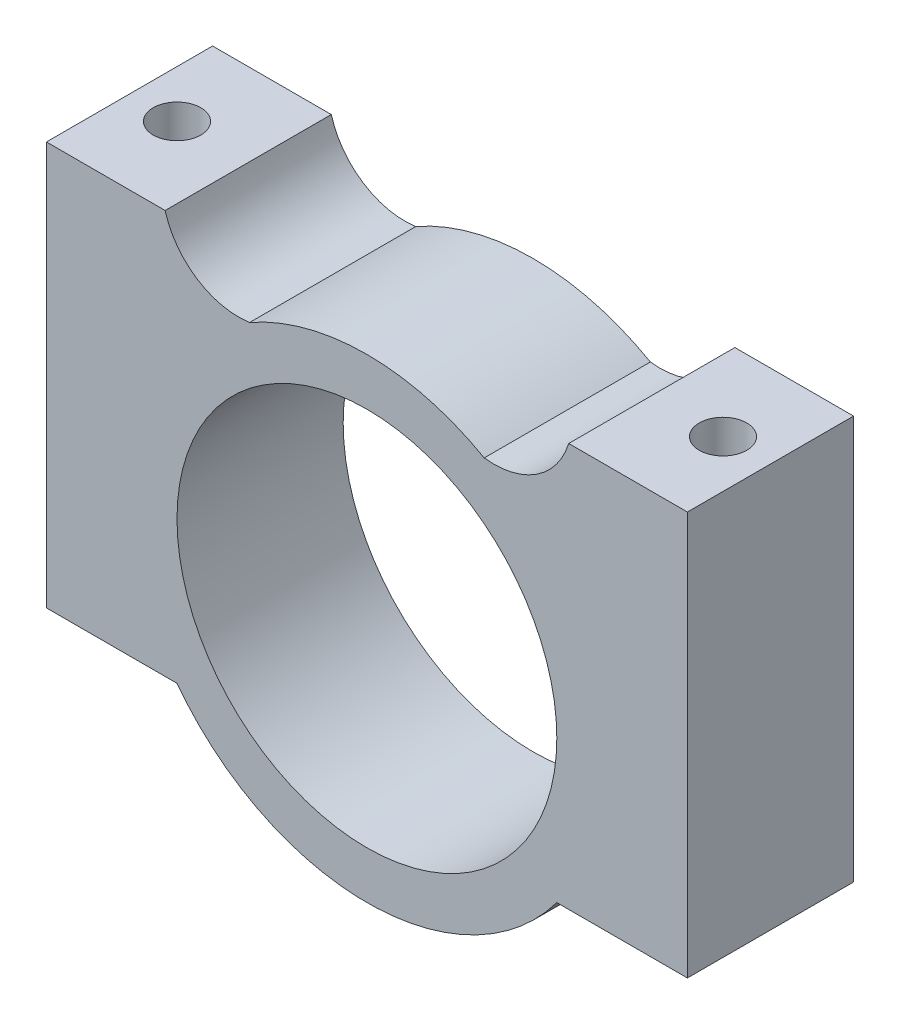
ISO-10303-21;
HEADER;
FILE_DESCRIPTION(('STEP AP214'),'2;1');
FILE_NAME('part.step','',(''),(''),'','','');
FILE_SCHEMA(('AUTOMOTIVE_DESIGN { 1 0 10303 214 1 1 1 1 }'));
ENDSEC;
DATA;
#1=APPLICATION_CONTEXT('core data for automotive mechanical design processes');
#2=APPLICATION_PROTOCOL_DEFINITION('international standard','automotive_design',2000,#1);
#3=PRODUCT_CONTEXT('',#1,'mechanical');
#4=PRODUCT('Part','Part','',(#3));
#5=PRODUCT_RELATED_PRODUCT_CATEGORY('part','',(#4));
#6=PRODUCT_DEFINITION_FORMATION('','',#4);
#7=PRODUCT_DEFINITION_CONTEXT('part definition',#1,'design');
#8=PRODUCT_DEFINITION('design','',#6,#7);
#9=PRODUCT_DEFINITION_SHAPE('','',#8);
#10=(LENGTH_UNIT() NAMED_UNIT(*) SI_UNIT(.MILLI.,.METRE.));
#11=(NAMED_UNIT(*) PLANE_ANGLE_UNIT() SI_UNIT($,.RADIAN.));
#12=(NAMED_UNIT(*) SI_UNIT($,.STERADIAN.) SOLID_ANGLE_UNIT());
#13=UNCERTAINTY_MEASURE_WITH_UNIT(LENGTH_MEASURE(1.E-05),#10,'distance_accuracy_value','');
#14=(GEOMETRIC_REPRESENTATION_CONTEXT(3) GLOBAL_UNCERTAINTY_ASSIGNED_CONTEXT((#13)) GLOBAL_UNIT_ASSIGNED_CONTEXT((#10,
#11,#12)) REPRESENTATION_CONTEXT('',''));
#15=CARTESIAN_POINT('',(0.,0.,0.));
#16=DIRECTION('',(0.,0.,1.));
#17=DIRECTION('',(1.,0.,0.));
#18=AXIS2_PLACEMENT_3D('',#15,#16,#17);
#19=CARTESIAN_POINT('',(5.35227036600319,9.45869811016463,7.));
#20=DIRECTION('',(0.,0.,-1.));
#21=DIRECTION('',(-1.,0.,0.));
#22=AXIS2_PLACEMENT_3D('',#19,#20,#21);
#23=PLANE('',#22);
#24=DIRECTION('',(1.,0.,0.));
#25=VECTOR('',#24,1.);
#26=CARTESIAN_POINT('',(8.,-8.5,7.));
#27=LINE('',#26,#25);
#28=CARTESIAN_POINT('',(8.,-8.5,7.));
#29=VERTEX_POINT('',#28);
#30=CARTESIAN_POINT('',(13.5,-8.5,7.));
#31=VERTEX_POINT('',#30);
#32=EDGE_CURVE('E186',#29,#31,#27,.T.);
#33=ORIENTED_EDGE('',*,*,#32,.T.);
#34=DIRECTION('',(0.,1.,0.));
#35=VECTOR('',#34,1.);
#36=CARTESIAN_POINT('',(13.5,8.5,7.));
#37=LINE('',#36,#35);
#38=CARTESIAN_POINT('',(13.5,8.5,7.));
#39=VERTEX_POINT('',#38);
#40=EDGE_CURVE('E110',#31,#39,#37,.T.);
#41=ORIENTED_EDGE('',*,*,#40,.T.);
#42=DIRECTION('',(-1.,0.,0.));
#43=VECTOR('',#42,1.);
#44=CARTESIAN_POINT('',(8.5,8.5,7.));
#45=LINE('',#44,#43);
#46=CARTESIAN_POINT('',(8.5,8.5,7.));
#47=VERTEX_POINT('',#46);
#48=EDGE_CURVE('E216',#39,#47,#45,.T.);
#49=ORIENTED_EDGE('',*,*,#48,.T.);
#50=CARTESIAN_POINT('',(5.35227036600319,9.45869811016463,7.));
#51=DIRECTION('',(0.,0.,-1.));
#52=DIRECTION('',(-1.,0.,0.));
#53=AXIS2_PLACEMENT_3D('',#50,#51,#52);
#54=CIRCLE('',#53,3.2904868811735);
#55=CARTESIAN_POINT('',(4.94108254715886,6.19400386830844,7.));
#56=VERTEX_POINT('',#55);
#57=EDGE_CURVE('E236',#47,#56,#54,.T.);
#58=ORIENTED_EDGE('',*,*,#57,.T.);
#59=CARTESIAN_POINT('',(0.,-2.5,7.));
#60=DIRECTION('',(0.,0.,1.));
#61=DIRECTION('',(1.,0.,0.));
#62=AXIS2_PLACEMENT_3D('',#59,#60,#61);
#63=CIRCLE('',#62,10.);
#64=CARTESIAN_POINT('',(-4.94108254715886,6.19400386830844,7.));
#65=VERTEX_POINT('',#64);
#66=EDGE_CURVE('E232',#56,#65,#63,.T.);
#67=ORIENTED_EDGE('',*,*,#66,.T.);
#68=CARTESIAN_POINT('',(-5.40975809367256,9.36997546466018,7.));
#69=DIRECTION('',(0.,0.,-1.));
#70=DIRECTION('',(1.,0.,0.));
#71=AXIS2_PLACEMENT_3D('',#68,#69,#70);
#72=CIRCLE('',#71,3.21036638855022);
#73=CARTESIAN_POINT('',(-8.5,8.5,7.));
#74=VERTEX_POINT('',#73);
#75=EDGE_CURVE('E235',#65,#74,#72,.T.);
#76=ORIENTED_EDGE('',*,*,#75,.T.);
#77=DIRECTION('',(-1.,0.,0.));
#78=VECTOR('',#77,1.);
#79=CARTESIAN_POINT('',(-13.5,8.5,7.));
#80=LINE('',#79,#78);
#81=CARTESIAN_POINT('',(-13.5,8.5,7.));
#82=VERTEX_POINT('',#81);
#83=EDGE_CURVE('E135',#74,#82,#80,.T.);
#84=ORIENTED_EDGE('',*,*,#83,.T.);
#85=DIRECTION('',(0.,-1.,0.));
#86=VECTOR('',#85,1.);
#87=CARTESIAN_POINT('',(-13.5,8.5,7.));
#88=LINE('',#87,#86);
#89=CARTESIAN_POINT('',(-13.5,-8.5,7.));
#90=VERTEX_POINT('',#89);
#91=EDGE_CURVE('E129',#82,#90,#88,.T.);
#92=ORIENTED_EDGE('',*,*,#91,.T.);
#93=DIRECTION('',(1.,0.,0.));
#94=VECTOR('',#93,1.);
#95=CARTESIAN_POINT('',(-13.5,-8.5,7.));
#96=LINE('',#95,#94);
#97=CARTESIAN_POINT('',(-8.,-8.5,7.));
#98=VERTEX_POINT('',#97);
#99=EDGE_CURVE('E133',#90,#98,#96,.T.);
#100=ORIENTED_EDGE('',*,*,#99,.T.);
#101=CARTESIAN_POINT('',(0.,-2.5,7.));
#102=DIRECTION('',(0.,0.,1.));
#103=DIRECTION('',(1.,0.,0.));
#104=AXIS2_PLACEMENT_3D('',#101,#102,#103);
#105=CIRCLE('',#104,10.);
#106=EDGE_CURVE('E61',#98,#29,#105,.T.);
#107=ORIENTED_EDGE('',*,*,#106,.T.);
#108=EDGE_LOOP('',(#33,#41,#49,#58,#67,#76,#84,#92,#100,#107));
#109=FACE_BOUND('',#108,.T.);
#110=CARTESIAN_POINT('',(0.,-2.5,7.));
#111=DIRECTION('',(0.,0.,1.));
#112=DIRECTION('',(1.,0.,0.));
#113=AXIS2_PLACEMENT_3D('',#110,#111,#112);
#114=CIRCLE('',#113,8.);
#115=CARTESIAN_POINT('',(8.,-2.5,7.));
#116=VERTEX_POINT('',#115);
#117=EDGE_CURVE('E162',#116,#116,#114,.T.);
#118=ORIENTED_EDGE('',*,*,#117,.F.);
#119=EDGE_LOOP('',(#118));
#120=FACE_BOUND('',#119,.T.);
#121=ADVANCED_FACE('F42',(#109,#120),#23,.F.);
#122=CARTESIAN_POINT('',(5.35227036600319,9.45869811016463,0.));
#123=DIRECTION('',(0.,0.,-1.));
#124=DIRECTION('',(-1.,0.,0.));
#125=AXIS2_PLACEMENT_3D('',#122,#123,#124);
#126=PLANE('',#125);
#127=DIRECTION('',(1.,0.,0.));
#128=VECTOR('',#127,1.);
#129=CARTESIAN_POINT('',(8.,-8.5,0.));
#130=LINE('',#129,#128);
#131=CARTESIAN_POINT('',(8.,-8.5,0.));
#132=VERTEX_POINT('',#131);
#133=CARTESIAN_POINT('',(13.5,-8.5,0.));
#134=VERTEX_POINT('',#133);
#135=EDGE_CURVE('E157',#132,#134,#130,.T.);
#136=ORIENTED_EDGE('',*,*,#135,.F.);
#137=CARTESIAN_POINT('',(0.,-2.5,0.));
#138=DIRECTION('',(0.,0.,1.));
#139=DIRECTION('',(1.,0.,0.));
#140=AXIS2_PLACEMENT_3D('',#137,#138,#139);
#141=CIRCLE('',#140,10.);
#142=CARTESIAN_POINT('',(-8.,-8.5,0.));
#143=VERTEX_POINT('',#142);
#144=EDGE_CURVE('E102',#143,#132,#141,.T.);
#145=ORIENTED_EDGE('',*,*,#144,.F.);
#146=DIRECTION('',(1.,0.,0.));
#147=VECTOR('',#146,1.);
#148=CARTESIAN_POINT('',(-13.5,-8.5,0.));
#149=LINE('',#148,#147);
#150=CARTESIAN_POINT('',(-13.5,-8.5,0.));
#151=VERTEX_POINT('',#150);
#152=EDGE_CURVE('E96',#151,#143,#149,.T.);
#153=ORIENTED_EDGE('',*,*,#152,.F.);
#154=DIRECTION('',(0.,-1.,0.));
#155=VECTOR('',#154,1.);
#156=CARTESIAN_POINT('',(-13.5,8.5,0.));
#157=LINE('',#156,#155);
#158=CARTESIAN_POINT('',(-13.5,8.5,0.));
#159=VERTEX_POINT('',#158);
#160=EDGE_CURVE('E144',#159,#151,#157,.T.);
#161=ORIENTED_EDGE('',*,*,#160,.F.);
#162=DIRECTION('',(-1.,0.,0.));
#163=VECTOR('',#162,1.);
#164=CARTESIAN_POINT('',(-13.5,8.5,0.));
#165=LINE('',#164,#163);
#166=CARTESIAN_POINT('',(-8.5,8.5,0.));
#167=VERTEX_POINT('',#166);
#168=EDGE_CURVE('E177',#167,#159,#165,.T.);
#169=ORIENTED_EDGE('',*,*,#168,.F.);
#170=CARTESIAN_POINT('',(-5.40975809367256,9.36997546466018,0.));
#171=DIRECTION('',(0.,0.,-1.));
#172=DIRECTION('',(1.,0.,0.));
#173=AXIS2_PLACEMENT_3D('',#170,#171,#172);
#174=CIRCLE('',#173,3.21036638855022);
#175=CARTESIAN_POINT('',(-4.94108254715886,6.19400386830844,0.));
#176=VERTEX_POINT('',#175);
#177=EDGE_CURVE('E174',#176,#167,#174,.T.);
#178=ORIENTED_EDGE('',*,*,#177,.F.);
#179=CARTESIAN_POINT('',(0.,-2.5,0.));
#180=DIRECTION('',(0.,0.,1.));
#181=DIRECTION('',(1.,0.,0.));
#182=AXIS2_PLACEMENT_3D('',#179,#180,#181);
#183=CIRCLE('',#182,10.);
#184=CARTESIAN_POINT('',(4.94108254715886,6.19400386830844,0.));
#185=VERTEX_POINT('',#184);
#186=EDGE_CURVE('E171',#185,#176,#183,.T.);
#187=ORIENTED_EDGE('',*,*,#186,.F.);
#188=CARTESIAN_POINT('',(5.35227036600319,9.45869811016463,0.));
#189=DIRECTION('',(0.,0.,-1.));
#190=DIRECTION('',(-1.,0.,0.));
#191=AXIS2_PLACEMENT_3D('',#188,#189,#190);
#192=CIRCLE('',#191,3.2904868811735);
#193=CARTESIAN_POINT('',(8.5,8.5,0.));
#194=VERTEX_POINT('',#193);
#195=EDGE_CURVE('E168',#194,#185,#192,.T.);
#196=ORIENTED_EDGE('',*,*,#195,.F.);
#197=DIRECTION('',(-1.,0.,0.));
#198=VECTOR('',#197,1.);
#199=CARTESIAN_POINT('',(8.5,8.5,0.));
#200=LINE('',#199,#198);
#201=CARTESIAN_POINT('',(13.5,8.5,0.));
#202=VERTEX_POINT('',#201);
#203=EDGE_CURVE('E165',#202,#194,#200,.T.);
#204=ORIENTED_EDGE('',*,*,#203,.F.);
#205=DIRECTION('',(0.,1.,0.));
#206=VECTOR('',#205,1.);
#207=CARTESIAN_POINT('',(13.5,8.5,0.));
#208=LINE('',#207,#206);
#209=EDGE_CURVE('E161',#134,#202,#208,.T.);
#210=ORIENTED_EDGE('',*,*,#209,.F.);
#211=EDGE_LOOP('',(#136,#145,#153,#161,#169,#178,#187,#196,#204,#210));
#212=FACE_BOUND('',#211,.T.);
#213=CARTESIAN_POINT('',(0.,-2.5,0.));
#214=DIRECTION('',(0.,0.,1.));
#215=DIRECTION('',(1.,0.,0.));
#216=AXIS2_PLACEMENT_3D('',#213,#214,#215);
#217=CIRCLE('',#216,8.);
#218=CARTESIAN_POINT('',(8.,-2.5,0.));
#219=VERTEX_POINT('',#218);
#220=EDGE_CURVE('E250',#219,#219,#217,.T.);
#221=ORIENTED_EDGE('',*,*,#220,.T.);
#222=EDGE_LOOP('',(#221));
#223=FACE_BOUND('',#222,.T.);
#224=ADVANCED_FACE('F220',(#212,#223),#126,.T.);
#225=CARTESIAN_POINT('',(8.,-8.5,7.));
#226=DIRECTION('',(0.,1.,0.));
#227=DIRECTION('',(-1.,0.,0.));
#228=AXIS2_PLACEMENT_3D('',#225,#226,#227);
#229=PLANE('',#228);
#230=CARTESIAN_POINT('',(11.5,-8.5,3.5));
#231=DIRECTION('',(0.,1.,0.));
#232=DIRECTION('',(-1.,0.,0.));
#233=AXIS2_PLACEMENT_3D('',#230,#231,#232);
#234=CIRCLE('',#233,1.);
#235=CARTESIAN_POINT('',(10.5,-8.5,3.5));
#236=VERTEX_POINT('',#235);
#237=EDGE_CURVE('E254',#236,#236,#234,.T.);
#238=ORIENTED_EDGE('',*,*,#237,.T.);
#239=EDGE_LOOP('',(#238));
#240=FACE_BOUND('',#239,.T.);
#241=ORIENTED_EDGE('',*,*,#135,.T.);
#242=DIRECTION('',(0.,0.,-1.));
#243=VECTOR('',#242,1.);
#244=CARTESIAN_POINT('',(13.5,-8.5,7.));
#245=LINE('',#244,#243);
#246=EDGE_CURVE('E11',#31,#134,#245,.T.);
#247=ORIENTED_EDGE('',*,*,#246,.F.);
#248=ORIENTED_EDGE('',*,*,#32,.F.);
#249=DIRECTION('',(0.,0.,-1.));
#250=VECTOR('',#249,1.);
#251=CARTESIAN_POINT('',(8.,-8.5,7.));
#252=LINE('',#251,#250);
#253=EDGE_CURVE('E153',#29,#132,#252,.T.);
#254=ORIENTED_EDGE('',*,*,#253,.T.);
#255=EDGE_LOOP('',(#241,#247,#248,#254));
#256=FACE_BOUND('',#255,.T.);
#257=ADVANCED_FACE('F44',(#240,#256),#229,.F.);
#258=CARTESIAN_POINT('',(13.5,8.5,7.));
#259=DIRECTION('',(-1.,0.,0.));
#260=DIRECTION('',(0.,-1.,0.));
#261=AXIS2_PLACEMENT_3D('',#258,#259,#260);
#262=PLANE('',#261);
#263=ORIENTED_EDGE('',*,*,#209,.T.);
#264=DIRECTION('',(0.,0.,-1.));
#265=VECTOR('',#264,1.);
#266=CARTESIAN_POINT('',(13.5,8.5,7.));
#267=LINE('',#266,#265);
#268=EDGE_CURVE('E53',#39,#202,#267,.T.);
#269=ORIENTED_EDGE('',*,*,#268,.F.);
#270=ORIENTED_EDGE('',*,*,#40,.F.);
#271=ORIENTED_EDGE('',*,*,#246,.T.);
#272=EDGE_LOOP('',(#263,#269,#270,#271));
#273=FACE_BOUND('',#272,.T.);
#274=ADVANCED_FACE('F315',(#273),#262,.F.);
#275=CARTESIAN_POINT('',(8.5,8.5,7.));
#276=DIRECTION('',(0.,-1.,0.));
#277=DIRECTION('',(0.,0.,-1.));
#278=AXIS2_PLACEMENT_3D('',#275,#276,#277);
#279=PLANE('',#278);
#280=CARTESIAN_POINT('',(11.5,8.5,3.5));
#281=DIRECTION('',(0.,1.,0.));
#282=DIRECTION('',(0.,0.,1.));
#283=AXIS2_PLACEMENT_3D('',#280,#281,#282);
#284=CIRCLE('',#283,1.);
#285=CARTESIAN_POINT('',(11.5,8.5,4.5));
#286=VERTEX_POINT('',#285);
#287=EDGE_CURVE('E261',#286,#286,#284,.T.);
#288=ORIENTED_EDGE('',*,*,#287,.F.);
#289=EDGE_LOOP('',(#288));
#290=FACE_BOUND('',#289,.T.);
#291=ORIENTED_EDGE('',*,*,#203,.T.);
#292=DIRECTION('',(0.,0.,-1.));
#293=VECTOR('',#292,1.);
#294=CARTESIAN_POINT('',(8.5,8.5,7.));
#295=LINE('',#294,#293);
#296=EDGE_CURVE('E205',#47,#194,#295,.T.);
#297=ORIENTED_EDGE('',*,*,#296,.F.);
#298=ORIENTED_EDGE('',*,*,#48,.F.);
#299=ORIENTED_EDGE('',*,*,#268,.T.);
#300=EDGE_LOOP('',(#291,#297,#298,#299));
#301=FACE_BOUND('',#300,.T.);
#302=ADVANCED_FACE('F214',(#290,#301),#279,.F.);
#303=CARTESIAN_POINT('',(5.35227036600319,9.45869811016463,7.));
#304=DIRECTION('',(0.,0.,-1.));
#305=DIRECTION('',(-1.,0.,0.));
#306=AXIS2_PLACEMENT_3D('',#303,#304,#305);
#307=CYLINDRICAL_SURFACE('',#306,3.2904868811735);
#308=ORIENTED_EDGE('',*,*,#195,.T.);
#309=DIRECTION('',(0.,0.,-1.));
#310=VECTOR('',#309,1.);
#311=CARTESIAN_POINT('',(4.94108254715886,6.19400386830844,7.));
#312=LINE('',#311,#310);
#313=EDGE_CURVE('E201',#56,#185,#312,.T.);
#314=ORIENTED_EDGE('',*,*,#313,.F.);
#315=ORIENTED_EDGE('',*,*,#57,.F.);
#316=ORIENTED_EDGE('',*,*,#296,.T.);
#317=EDGE_LOOP('',(#308,#314,#315,#316));
#318=FACE_BOUND('',#317,.T.);
#319=ADVANCED_FACE('F226',(#318),#307,.F.);
#320=CARTESIAN_POINT('',(0.,-2.5,7.));
#321=DIRECTION('',(0.,0.,-1.));
#322=DIRECTION('',(-1.,0.,0.));
#323=AXIS2_PLACEMENT_3D('',#320,#321,#322);
#324=CYLINDRICAL_SURFACE('',#323,10.);
#325=ORIENTED_EDGE('',*,*,#186,.T.);
#326=DIRECTION('',(0.,0.,-1.));
#327=VECTOR('',#326,1.);
#328=CARTESIAN_POINT('',(-4.94108254715886,6.19400386830844,7.));
#329=LINE('',#328,#327);
#330=EDGE_CURVE('E197',#65,#176,#329,.T.);
#331=ORIENTED_EDGE('',*,*,#330,.F.);
#332=ORIENTED_EDGE('',*,*,#66,.F.);
#333=ORIENTED_EDGE('',*,*,#313,.T.);
#334=EDGE_LOOP('',(#325,#331,#332,#333));
#335=FACE_BOUND('',#334,.T.);
#336=ADVANCED_FACE('F230',(#335),#324,.T.);
#337=CARTESIAN_POINT('',(-5.40975809367256,9.36997546466018,7.));
#338=DIRECTION('',(0.,0.,-1.));
#339=DIRECTION('',(-1.,0.,0.));
#340=AXIS2_PLACEMENT_3D('',#337,#338,#339);
#341=CYLINDRICAL_SURFACE('',#340,3.21036638855022);
#342=ORIENTED_EDGE('',*,*,#177,.T.);
#343=DIRECTION('',(0.,0.,-1.));
#344=VECTOR('',#343,1.);
#345=CARTESIAN_POINT('',(-8.5,8.5,7.));
#346=LINE('',#345,#344);
#347=EDGE_CURVE('E193',#74,#167,#346,.T.);
#348=ORIENTED_EDGE('',*,*,#347,.F.);
#349=ORIENTED_EDGE('',*,*,#75,.F.);
#350=ORIENTED_EDGE('',*,*,#330,.T.);
#351=EDGE_LOOP('',(#342,#348,#349,#350));
#352=FACE_BOUND('',#351,.T.);
#353=ADVANCED_FACE('F305',(#352),#341,.F.);
#354=CARTESIAN_POINT('',(-13.5,8.5,7.));
#355=DIRECTION('',(0.,-1.,0.));
#356=DIRECTION('',(0.,0.,-1.));
#357=AXIS2_PLACEMENT_3D('',#354,#355,#356);
#358=PLANE('',#357);
#359=CARTESIAN_POINT('',(-11.5,8.5,3.5));
#360=DIRECTION('',(0.,1.,0.));
#361=DIRECTION('',(0.,0.,1.));
#362=AXIS2_PLACEMENT_3D('',#359,#360,#361);
#363=CIRCLE('',#362,1.);
#364=CARTESIAN_POINT('',(-11.5,8.5,4.5));
#365=VERTEX_POINT('',#364);
#366=EDGE_CURVE('E265',#365,#365,#363,.T.);
#367=ORIENTED_EDGE('',*,*,#366,.F.);
#368=EDGE_LOOP('',(#367));
#369=FACE_BOUND('',#368,.T.);
#370=ORIENTED_EDGE('',*,*,#168,.T.);
#371=DIRECTION('',(0.,0.,-1.));
#372=VECTOR('',#371,1.);
#373=CARTESIAN_POINT('',(-13.5,8.5,7.));
#374=LINE('',#373,#372);
#375=EDGE_CURVE('E146',#82,#159,#374,.T.);
#376=ORIENTED_EDGE('',*,*,#375,.F.);
#377=ORIENTED_EDGE('',*,*,#83,.F.);
#378=ORIENTED_EDGE('',*,*,#347,.T.);
#379=EDGE_LOOP('',(#370,#376,#377,#378));
#380=FACE_BOUND('',#379,.T.);
#381=ADVANCED_FACE('F302',(#369,#380),#358,.F.);
#382=CARTESIAN_POINT('',(-13.5,8.5,7.));
#383=DIRECTION('',(1.,0.,0.));
#384=DIRECTION('',(0.,1.,0.));
#385=AXIS2_PLACEMENT_3D('',#382,#383,#384);
#386=PLANE('',#385);
#387=ORIENTED_EDGE('',*,*,#160,.T.);
#388=DIRECTION('',(0.,0.,-1.));
#389=VECTOR('',#388,1.);
#390=CARTESIAN_POINT('',(-13.5,-8.5,7.));
#391=LINE('',#390,#389);
#392=EDGE_CURVE('E141',#90,#151,#391,.T.);
#393=ORIENTED_EDGE('',*,*,#392,.F.);
#394=ORIENTED_EDGE('',*,*,#91,.F.);
#395=ORIENTED_EDGE('',*,*,#375,.T.);
#396=EDGE_LOOP('',(#387,#393,#394,#395));
#397=FACE_BOUND('',#396,.T.);
#398=ADVANCED_FACE('F142',(#397),#386,.F.);
#399=CARTESIAN_POINT('',(-13.5,-8.5,7.));
#400=DIRECTION('',(0.,1.,0.));
#401=DIRECTION('',(-1.,0.,0.));
#402=AXIS2_PLACEMENT_3D('',#399,#400,#401);
#403=PLANE('',#402);
#404=CARTESIAN_POINT('',(-11.5,-8.5,3.5));
#405=DIRECTION('',(0.,1.,0.));
#406=DIRECTION('',(-1.,0.,0.));
#407=AXIS2_PLACEMENT_3D('',#404,#405,#406);
#408=CIRCLE('',#407,1.);
#409=CARTESIAN_POINT('',(-12.5,-8.5,3.5));
#410=VERTEX_POINT('',#409);
#411=EDGE_CURVE('E46',#410,#410,#408,.T.);
#412=ORIENTED_EDGE('',*,*,#411,.T.);
#413=EDGE_LOOP('',(#412));
#414=FACE_BOUND('',#413,.T.);
#415=ORIENTED_EDGE('',*,*,#152,.T.);
#416=DIRECTION('',(0.,0.,-1.));
#417=VECTOR('',#416,1.);
#418=CARTESIAN_POINT('',(-8.,-8.5,7.));
#419=LINE('',#418,#417);
#420=EDGE_CURVE('E147',#98,#143,#419,.T.);
#421=ORIENTED_EDGE('',*,*,#420,.F.);
#422=ORIENTED_EDGE('',*,*,#99,.F.);
#423=ORIENTED_EDGE('',*,*,#392,.T.);
#424=EDGE_LOOP('',(#415,#421,#422,#423));
#425=FACE_BOUND('',#424,.T.);
#426=ADVANCED_FACE('F149',(#414,#425),#403,.F.);
#427=CARTESIAN_POINT('',(0.,-2.5,7.));
#428=DIRECTION('',(0.,0.,-1.));
#429=DIRECTION('',(-1.,0.,0.));
#430=AXIS2_PLACEMENT_3D('',#427,#428,#429);
#431=CYLINDRICAL_SURFACE('',#430,10.);
#432=ORIENTED_EDGE('',*,*,#144,.T.);
#433=ORIENTED_EDGE('',*,*,#253,.F.);
#434=ORIENTED_EDGE('',*,*,#106,.F.);
#435=ORIENTED_EDGE('',*,*,#420,.T.);
#436=EDGE_LOOP('',(#432,#433,#434,#435));
#437=FACE_BOUND('',#436,.T.);
#438=ADVANCED_FACE('F286',(#437),#431,.T.);
#439=CARTESIAN_POINT('',(0.,-2.5,7.));
#440=DIRECTION('',(0.,0.,-1.));
#441=DIRECTION('',(-1.,0.,0.));
#442=AXIS2_PLACEMENT_3D('',#439,#440,#441);
#443=CYLINDRICAL_SURFACE('',#442,8.);
#444=ORIENTED_EDGE('',*,*,#117,.T.);
#445=EDGE_LOOP('',(#444));
#446=FACE_BOUND('',#445,.T.);
#447=ORIENTED_EDGE('',*,*,#220,.F.);
#448=EDGE_LOOP('',(#447));
#449=FACE_BOUND('',#448,.T.);
#450=ADVANCED_FACE('F278',(#446,#449),#443,.F.);
#451=CARTESIAN_POINT('',(-11.5,-12.5,3.5));
#452=DIRECTION('',(0.,1.,0.));
#453=DIRECTION('',(0.,0.,1.));
#454=AXIS2_PLACEMENT_3D('',#451,#452,#453);
#455=CYLINDRICAL_SURFACE('',#454,1.);
#456=ORIENTED_EDGE('',*,*,#366,.T.);
#457=EDGE_LOOP('',(#456));
#458=FACE_BOUND('',#457,.T.);
#459=ORIENTED_EDGE('',*,*,#411,.F.);
#460=EDGE_LOOP('',(#459));
#461=FACE_BOUND('',#460,.T.);
#462=ADVANCED_FACE('F275',(#458,#461),#455,.F.);
#463=CARTESIAN_POINT('',(11.5,-12.5,3.5));
#464=DIRECTION('',(0.,1.,0.));
#465=DIRECTION('',(0.,0.,1.));
#466=AXIS2_PLACEMENT_3D('',#463,#464,#465);
#467=CYLINDRICAL_SURFACE('',#466,1.);
#468=ORIENTED_EDGE('',*,*,#287,.T.);
#469=EDGE_LOOP('',(#468));
#470=FACE_BOUND('',#469,.T.);
#471=ORIENTED_EDGE('',*,*,#237,.F.);
#472=EDGE_LOOP('',(#471));
#473=FACE_BOUND('',#472,.T.);
#474=ADVANCED_FACE('F277',(#470,#473),#467,.F.);
#475=CLOSED_SHELL('',(#121,#224,#257,#274,#302,#319,#336,#353,#381,#398,#426,#438,#450,#462,#474));
#476=MANIFOLD_SOLID_BREP('B2',#475);
#477=ADVANCED_BREP_SHAPE_REPRESENTATION('',(#18,#476),#14);
#478=SHAPE_DEFINITION_REPRESENTATION(#9,#477);
ENDSEC;
END-ISO-10303-21;
